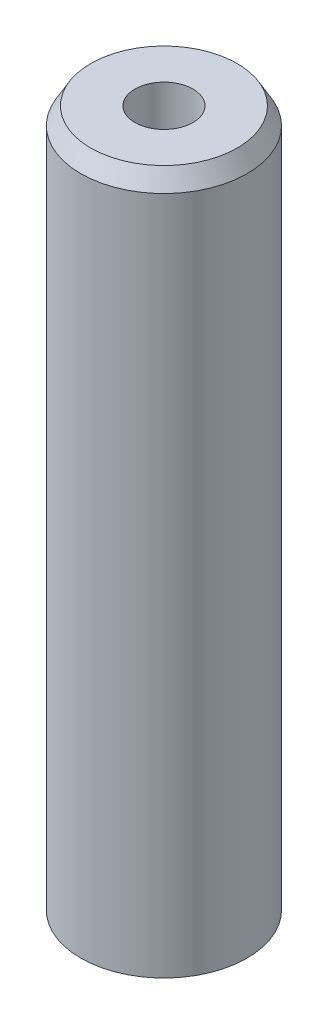
ISO-10303-21;
HEADER;
FILE_DESCRIPTION(('STEP AP214'),'2;1');
FILE_NAME('part.step','',(''),(''),'','','');
FILE_SCHEMA(('AUTOMOTIVE_DESIGN { 1 0 10303 214 1 1 1 1 }'));
ENDSEC;
DATA;
#1=APPLICATION_CONTEXT('core data for automotive mechanical design processes');
#2=APPLICATION_PROTOCOL_DEFINITION('international standard','automotive_design',2000,#1);
#3=PRODUCT_CONTEXT('',#1,'mechanical');
#4=PRODUCT('Part','Part','',(#3));
#5=PRODUCT_RELATED_PRODUCT_CATEGORY('part','',(#4));
#6=PRODUCT_DEFINITION_FORMATION('','',#4);
#7=PRODUCT_DEFINITION_CONTEXT('part definition',#1,'design');
#8=PRODUCT_DEFINITION('design','',#6,#7);
#9=PRODUCT_DEFINITION_SHAPE('','',#8);
#10=(LENGTH_UNIT() NAMED_UNIT(*) SI_UNIT(.MILLI.,.METRE.));
#11=(NAMED_UNIT(*) PLANE_ANGLE_UNIT() SI_UNIT($,.RADIAN.));
#12=(NAMED_UNIT(*) SI_UNIT($,.STERADIAN.) SOLID_ANGLE_UNIT());
#13=UNCERTAINTY_MEASURE_WITH_UNIT(LENGTH_MEASURE(1.E-05),#10,'distance_accuracy_value','');
#14=(GEOMETRIC_REPRESENTATION_CONTEXT(3) GLOBAL_UNCERTAINTY_ASSIGNED_CONTEXT((#13)) GLOBAL_UNIT_ASSIGNED_CONTEXT((#10,
#11,#12)) REPRESENTATION_CONTEXT('',''));
#15=CARTESIAN_POINT('',(0.,0.,0.));
#16=DIRECTION('',(0.,0.,1.));
#17=DIRECTION('',(1.,0.,0.));
#18=AXIS2_PLACEMENT_3D('',#15,#16,#17);
#19=CARTESIAN_POINT('',(0.,212.388772592596,0.));
#20=DIRECTION('',(0.,-1.,0.));
#21=DIRECTION('',(0.,0.,-1.));
#22=AXIS2_PLACEMENT_3D('',#19,#20,#21);
#23=CYLINDRICAL_SURFACE('',#22,25.);
#24=CARTESIAN_POINT('',(0.,207.213193964932,0.));
#25=DIRECTION('',(0.,1.,0.));
#26=DIRECTION('',(0.,0.,1.));
#27=AXIS2_PLACEMENT_3D('',#24,#25,#26);
#28=CIRCLE('',#27,25.);
#29=CARTESIAN_POINT('',(0.,207.213193964932,25.));
#30=VERTEX_POINT('',#29);
#31=EDGE_CURVE('E50',#30,#30,#28,.F.);
#32=ORIENTED_EDGE('',*,*,#31,.T.);
#33=EDGE_LOOP('',(#32));
#34=FACE_BOUND('',#33,.T.);
#35=CARTESIAN_POINT('',(0.,2.98812171389354,0.));
#36=DIRECTION('',(0.,1.,0.));
#37=DIRECTION('',(0.,0.,1.));
#38=AXIS2_PLACEMENT_3D('',#35,#36,#37);
#39=CIRCLE('',#38,25.);
#40=CARTESIAN_POINT('',(0.,2.98812171389354,25.));
#41=VERTEX_POINT('',#40);
#42=EDGE_CURVE('E51',#41,#41,#39,.T.);
#43=ORIENTED_EDGE('',*,*,#42,.T.);
#44=EDGE_LOOP('',(#43));
#45=FACE_BOUND('',#44,.T.);
#46=ADVANCED_FACE('F39',(#34,#45),#23,.T.);
#47=CARTESIAN_POINT('',(0.,212.388772592596,0.));
#48=DIRECTION('',(0.,1.,0.));
#49=DIRECTION('',(0.,0.,1.));
#50=AXIS2_PLACEMENT_3D('',#47,#48,#49);
#51=PLANE('',#50);
#52=CARTESIAN_POINT('',(0.,212.388772592596,0.));
#53=DIRECTION('',(0.,1.,0.));
#54=DIRECTION('',(0.,0.,1.));
#55=AXIS2_PLACEMENT_3D('',#52,#53,#54);
#56=CIRCLE('',#55,22.0118782861065);
#57=CARTESIAN_POINT('',(0.,212.388772592596,22.0118782861065));
#58=VERTEX_POINT('',#57);
#59=EDGE_CURVE('E54',#58,#58,#56,.T.);
#60=ORIENTED_EDGE('',*,*,#59,.T.);
#61=EDGE_LOOP('',(#60));
#62=FACE_BOUND('',#61,.T.);
#63=CARTESIAN_POINT('',(0.,212.388772592596,0.));
#64=DIRECTION('',(0.,1.,0.));
#65=DIRECTION('',(0.,0.,1.));
#66=AXIS2_PLACEMENT_3D('',#63,#64,#65);
#67=CIRCLE('',#66,8.72903492672748);
#68=CARTESIAN_POINT('',(0.,212.388772592596,8.72903492672748));
#69=VERTEX_POINT('',#68);
#70=EDGE_CURVE('E58',#69,#69,#67,.T.);
#71=ORIENTED_EDGE('',*,*,#70,.F.);
#72=EDGE_LOOP('',(#71));
#73=FACE_BOUND('',#72,.T.);
#74=ADVANCED_FACE('F69',(#62,#73),#51,.T.);
#75=CARTESIAN_POINT('',(0.,0.,0.));
#76=DIRECTION('',(0.,1.,0.));
#77=DIRECTION('',(0.,0.,1.));
#78=AXIS2_PLACEMENT_3D('',#75,#76,#77);
#79=PLANE('',#78);
#80=CARTESIAN_POINT('',(0.,0.,0.));
#81=DIRECTION('',(0.,1.,0.));
#82=DIRECTION('',(0.,0.,1.));
#83=AXIS2_PLACEMENT_3D('',#80,#81,#82);
#84=CIRCLE('',#83,19.8244213723366);
#85=CARTESIAN_POINT('',(0.,0.,19.8244213723366));
#86=VERTEX_POINT('',#85);
#87=EDGE_CURVE('E10',#86,#86,#84,.F.);
#88=ORIENTED_EDGE('',*,*,#87,.T.);
#89=EDGE_LOOP('',(#88));
#90=FACE_BOUND('',#89,.T.);
#91=CARTESIAN_POINT('',(0.,0.,0.));
#92=DIRECTION('',(0.,1.,0.));
#93=DIRECTION('',(0.,0.,1.));
#94=AXIS2_PLACEMENT_3D('',#91,#92,#93);
#95=CIRCLE('',#94,8.72903492672748);
#96=CARTESIAN_POINT('',(0.,0.,8.72903492672748));
#97=VERTEX_POINT('',#96);
#98=EDGE_CURVE('E63',#97,#97,#95,.T.);
#99=ORIENTED_EDGE('',*,*,#98,.T.);
#100=EDGE_LOOP('',(#99));
#101=FACE_BOUND('',#100,.T.);
#102=ADVANCED_FACE('F75',(#90,#101),#79,.F.);
#103=CARTESIAN_POINT('',(0.,212.388772592596,0.));
#104=DIRECTION('',(0.,-1.,0.));
#105=DIRECTION('',(0.,0.,-1.));
#106=AXIS2_PLACEMENT_3D('',#103,#104,#105);
#107=CYLINDRICAL_SURFACE('',#106,8.72903492672748);
#108=ORIENTED_EDGE('',*,*,#70,.T.);
#109=EDGE_LOOP('',(#108));
#110=FACE_BOUND('',#109,.T.);
#111=ORIENTED_EDGE('',*,*,#98,.F.);
#112=EDGE_LOOP('',(#111));
#113=FACE_BOUND('',#112,.T.);
#114=ADVANCED_FACE('F70',(#110,#113),#107,.F.);
#115=CARTESIAN_POINT('',(0.,212.388772592596,0.));
#116=DIRECTION('',(0.,-1.,0.));
#117=DIRECTION('',(0.,0.,-1.));
#118=AXIS2_PLACEMENT_3D('',#115,#116,#117);
#119=CONICAL_SURFACE('',#118,22.0118782861065,0.523598775598297);
#120=ORIENTED_EDGE('',*,*,#31,.F.);
#121=EDGE_LOOP('',(#120));
#122=FACE_BOUND('',#121,.T.);
#123=ORIENTED_EDGE('',*,*,#59,.F.);
#124=EDGE_LOOP('',(#123));
#125=FACE_BOUND('',#124,.T.);
#126=ADVANCED_FACE('F81',(#122,#125),#119,.T.);
#127=CARTESIAN_POINT('',(0.,2.98812171389354,0.));
#128=DIRECTION('',(0.,1.,0.));
#129=DIRECTION('',(0.,0.,1.));
#130=AXIS2_PLACEMENT_3D('',#127,#128,#129);
#131=CONICAL_SURFACE('',#130,25.,1.0471975511966);
#132=ORIENTED_EDGE('',*,*,#87,.F.);
#133=EDGE_LOOP('',(#132));
#134=FACE_BOUND('',#133,.T.);
#135=ORIENTED_EDGE('',*,*,#42,.F.);
#136=EDGE_LOOP('',(#135));
#137=FACE_BOUND('',#136,.T.);
#138=ADVANCED_FACE('F45',(#134,#137),#131,.T.);
#139=CLOSED_SHELL('',(#46,#74,#102,#114,#126,#138));
#140=MANIFOLD_SOLID_BREP('B2',#139);
#141=ADVANCED_BREP_SHAPE_REPRESENTATION('',(#18,#140),#14);
#142=SHAPE_DEFINITION_REPRESENTATION(#9,#141);
ENDSEC;
END-ISO-10303-21;
